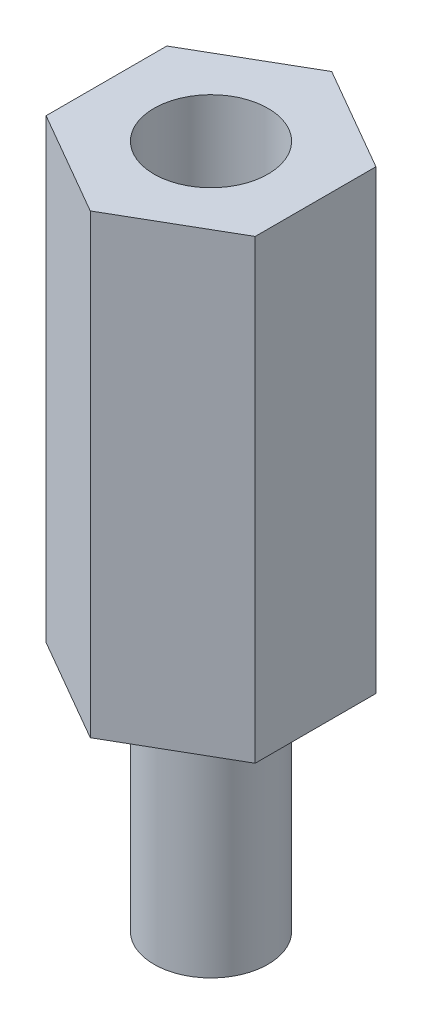
ISO-10303-21;
HEADER;
FILE_DESCRIPTION(('STEP AP214'),'2;1');
FILE_NAME('part.step','',(''),(''),'','','');
FILE_SCHEMA(('AUTOMOTIVE_DESIGN { 1 0 10303 214 1 1 1 1 }'));
ENDSEC;
DATA;
#1=APPLICATION_CONTEXT('core data for automotive mechanical design processes');
#2=APPLICATION_PROTOCOL_DEFINITION('international standard','automotive_design',2000,#1);
#3=PRODUCT_CONTEXT('',#1,'mechanical');
#4=PRODUCT('Part','Part','',(#3));
#5=PRODUCT_RELATED_PRODUCT_CATEGORY('part','',(#4));
#6=PRODUCT_DEFINITION_FORMATION('','',#4);
#7=PRODUCT_DEFINITION_CONTEXT('part definition',#1,'design');
#8=PRODUCT_DEFINITION('design','',#6,#7);
#9=PRODUCT_DEFINITION_SHAPE('','',#8);
#10=(LENGTH_UNIT() NAMED_UNIT(*) SI_UNIT(.MILLI.,.METRE.));
#11=(NAMED_UNIT(*) PLANE_ANGLE_UNIT() SI_UNIT($,.RADIAN.));
#12=(NAMED_UNIT(*) SI_UNIT($,.STERADIAN.) SOLID_ANGLE_UNIT());
#13=UNCERTAINTY_MEASURE_WITH_UNIT(LENGTH_MEASURE(1.E-05),#10,'distance_accuracy_value','');
#14=(GEOMETRIC_REPRESENTATION_CONTEXT(3) GLOBAL_UNCERTAINTY_ASSIGNED_CONTEXT((#13)) GLOBAL_UNIT_ASSIGNED_CONTEXT((#10,
#11,#12)) REPRESENTATION_CONTEXT('',''));
#15=CARTESIAN_POINT('',(0.,0.,0.));
#16=DIRECTION('',(0.,0.,1.));
#17=DIRECTION('',(1.,0.,0.));
#18=AXIS2_PLACEMENT_3D('',#15,#16,#17);
#19=CARTESIAN_POINT('',(2.74999999999998,12.,-1.5877132402715));
#20=DIRECTION('',(-0.499999999999995,0.,0.866025403784441));
#21=DIRECTION('',(0.866025403784441,0.,0.499999999999995));
#22=AXIS2_PLACEMENT_3D('',#19,#20,#21);
#23=PLANE('',#22);
#24=DIRECTION('',(-0.866025403784441,0.,-0.499999999999995));
#25=VECTOR('',#24,1.);
#26=CARTESIAN_POINT('',(2.74999999999998,0.,-1.5877132402715));
#27=LINE('',#26,#25);
#28=CARTESIAN_POINT('',(2.74999999999998,0.,-1.5877132402715));
#29=VERTEX_POINT('',#28);
#30=CARTESIAN_POINT('',(0.,0.,-3.17542648054294));
#31=VERTEX_POINT('',#30);
#32=EDGE_CURVE('E120',#29,#31,#27,.T.);
#33=ORIENTED_EDGE('',*,*,#32,.T.);
#34=DIRECTION('',(0.,-1.,0.));
#35=VECTOR('',#34,1.);
#36=CARTESIAN_POINT('',(0.,12.,-3.17542648054294));
#37=LINE('',#36,#35);
#38=CARTESIAN_POINT('',(0.,12.,-3.17542648054294));
#39=VERTEX_POINT('',#38);
#40=EDGE_CURVE('E37',#39,#31,#37,.T.);
#41=ORIENTED_EDGE('',*,*,#40,.F.);
#42=DIRECTION('',(-0.866025403784441,0.,-0.499999999999995));
#43=VECTOR('',#42,1.);
#44=CARTESIAN_POINT('',(2.74999999999998,12.,-1.5877132402715));
#45=LINE('',#44,#43);
#46=CARTESIAN_POINT('',(2.74999999999998,12.,-1.5877132402715));
#47=VERTEX_POINT('',#46);
#48=EDGE_CURVE('E131',#47,#39,#45,.T.);
#49=ORIENTED_EDGE('',*,*,#48,.F.);
#50=DIRECTION('',(0.,-1.,0.));
#51=VECTOR('',#50,1.);
#52=CARTESIAN_POINT('',(2.74999999999998,12.,-1.5877132402715));
#53=LINE('',#52,#51);
#54=EDGE_CURVE('E116',#47,#29,#53,.T.);
#55=ORIENTED_EDGE('',*,*,#54,.T.);
#56=EDGE_LOOP('',(#33,#41,#49,#55));
#57=FACE_BOUND('',#56,.T.);
#58=ADVANCED_FACE('F34',(#57),#23,.F.);
#59=CARTESIAN_POINT('',(0.,12.,-3.17542648054294));
#60=DIRECTION('',(0.500000000000001,0.,0.866025403784438));
#61=DIRECTION('',(0.866025403784438,0.,-0.500000000000001));
#62=AXIS2_PLACEMENT_3D('',#59,#60,#61);
#63=PLANE('',#62);
#64=DIRECTION('',(-0.866025403784438,0.,0.500000000000001));
#65=VECTOR('',#64,1.);
#66=CARTESIAN_POINT('',(0.,0.,-3.17542648054294));
#67=LINE('',#66,#65);
#68=CARTESIAN_POINT('',(-2.75,0.,-1.58771324027146));
#69=VERTEX_POINT('',#68);
#70=EDGE_CURVE('E123',#31,#69,#67,.T.);
#71=ORIENTED_EDGE('',*,*,#70,.T.);
#72=DIRECTION('',(0.,-1.,0.));
#73=VECTOR('',#72,1.);
#74=CARTESIAN_POINT('',(-2.75,12.,-1.58771324027146));
#75=LINE('',#74,#73);
#76=CARTESIAN_POINT('',(-2.75,12.,-1.58771324027146));
#77=VERTEX_POINT('',#76);
#78=EDGE_CURVE('E134',#77,#69,#75,.T.);
#79=ORIENTED_EDGE('',*,*,#78,.F.);
#80=DIRECTION('',(-0.866025403784438,0.,0.500000000000001));
#81=VECTOR('',#80,1.);
#82=CARTESIAN_POINT('',(0.,12.,-3.17542648054294));
#83=LINE('',#82,#81);
#84=EDGE_CURVE('E89',#39,#77,#83,.T.);
#85=ORIENTED_EDGE('',*,*,#84,.F.);
#86=ORIENTED_EDGE('',*,*,#40,.T.);
#87=EDGE_LOOP('',(#71,#79,#85,#86));
#88=FACE_BOUND('',#87,.T.);
#89=ADVANCED_FACE('F139',(#88),#63,.F.);
#90=CARTESIAN_POINT('',(-2.75,12.,-1.58771324027146));
#91=DIRECTION('',(1.,0.,0.));
#92=DIRECTION('',(0.,0.,-1.));
#93=AXIS2_PLACEMENT_3D('',#90,#91,#92);
#94=PLANE('',#93);
#95=DIRECTION('',(0.,0.,1.));
#96=VECTOR('',#95,1.);
#97=CARTESIAN_POINT('',(-2.75,0.,-1.58771324027146));
#98=LINE('',#97,#96);
#99=CARTESIAN_POINT('',(-2.74999999999999,0.,1.58771324027148));
#100=VERTEX_POINT('',#99);
#101=EDGE_CURVE('E126',#69,#100,#98,.T.);
#102=ORIENTED_EDGE('',*,*,#101,.T.);
#103=DIRECTION('',(0.,-1.,0.));
#104=VECTOR('',#103,1.);
#105=CARTESIAN_POINT('',(-2.74999999999999,12.,1.58771324027148));
#106=LINE('',#105,#104);
#107=CARTESIAN_POINT('',(-2.74999999999999,12.,1.58771324027148));
#108=VERTEX_POINT('',#107);
#109=EDGE_CURVE('E111',#108,#100,#106,.T.);
#110=ORIENTED_EDGE('',*,*,#109,.F.);
#111=DIRECTION('',(0.,0.,1.));
#112=VECTOR('',#111,1.);
#113=CARTESIAN_POINT('',(-2.75,12.,-1.58771324027146));
#114=LINE('',#113,#112);
#115=EDGE_CURVE('E102',#77,#108,#114,.T.);
#116=ORIENTED_EDGE('',*,*,#115,.F.);
#117=ORIENTED_EDGE('',*,*,#78,.T.);
#118=EDGE_LOOP('',(#102,#110,#116,#117));
#119=FACE_BOUND('',#118,.T.);
#120=ADVANCED_FACE('F145',(#119),#94,.F.);
#121=CARTESIAN_POINT('',(-2.74999999999999,12.,1.58771324027148));
#122=DIRECTION('',(0.499999999999995,0.,-0.866025403784441));
#123=DIRECTION('',(-0.866025403784442,0.,-0.499999999999995));
#124=AXIS2_PLACEMENT_3D('',#121,#122,#123);
#125=PLANE('',#124);
#126=DIRECTION('',(0.866025403784442,0.,0.499999999999995));
#127=VECTOR('',#126,1.);
#128=CARTESIAN_POINT('',(-2.74999999999999,0.,1.58771324027148));
#129=LINE('',#128,#127);
#130=CARTESIAN_POINT('',(0.,0.,3.17542648054294));
#131=VERTEX_POINT('',#130);
#132=EDGE_CURVE('E110',#100,#131,#129,.T.);
#133=ORIENTED_EDGE('',*,*,#132,.T.);
#134=DIRECTION('',(0.,-1.,0.));
#135=VECTOR('',#134,1.);
#136=CARTESIAN_POINT('',(0.,12.,3.17542648054294));
#137=LINE('',#136,#135);
#138=CARTESIAN_POINT('',(0.,12.,3.17542648054294));
#139=VERTEX_POINT('',#138);
#140=EDGE_CURVE('E107',#139,#131,#137,.T.);
#141=ORIENTED_EDGE('',*,*,#140,.F.);
#142=DIRECTION('',(0.866025403784442,0.,0.499999999999995));
#143=VECTOR('',#142,1.);
#144=CARTESIAN_POINT('',(-2.74999999999999,12.,1.58771324027148));
#145=LINE('',#144,#143);
#146=EDGE_CURVE('E96',#108,#139,#145,.T.);
#147=ORIENTED_EDGE('',*,*,#146,.F.);
#148=ORIENTED_EDGE('',*,*,#109,.T.);
#149=EDGE_LOOP('',(#133,#141,#147,#148));
#150=FACE_BOUND('',#149,.T.);
#151=ADVANCED_FACE('F108',(#150),#125,.F.);
#152=CARTESIAN_POINT('',(0.,12.,3.17542648054294));
#153=DIRECTION('',(-0.500000000000007,0.,-0.866025403784434));
#154=DIRECTION('',(-0.866025403784435,0.,0.500000000000007));
#155=AXIS2_PLACEMENT_3D('',#152,#153,#154);
#156=PLANE('',#155);
#157=DIRECTION('',(0.866025403784434,0.,-0.500000000000007));
#158=VECTOR('',#157,1.);
#159=CARTESIAN_POINT('',(0.,0.,3.17542648054294));
#160=LINE('',#159,#158);
#161=CARTESIAN_POINT('',(2.75000000000001,0.,1.58771324027144));
#162=VERTEX_POINT('',#161);
#163=EDGE_CURVE('E74',#131,#162,#160,.T.);
#164=ORIENTED_EDGE('',*,*,#163,.T.);
#165=DIRECTION('',(0.,-1.,0.));
#166=VECTOR('',#165,1.);
#167=CARTESIAN_POINT('',(2.75000000000001,12.,1.58771324027144));
#168=LINE('',#167,#166);
#169=CARTESIAN_POINT('',(2.75000000000001,12.,1.58771324027144));
#170=VERTEX_POINT('',#169);
#171=EDGE_CURVE('E112',#170,#162,#168,.T.);
#172=ORIENTED_EDGE('',*,*,#171,.F.);
#173=DIRECTION('',(0.866025403784434,0.,-0.500000000000007));
#174=VECTOR('',#173,1.);
#175=CARTESIAN_POINT('',(0.,12.,3.17542648054294));
#176=LINE('',#175,#174);
#177=EDGE_CURVE('E100',#139,#170,#176,.T.);
#178=ORIENTED_EDGE('',*,*,#177,.F.);
#179=ORIENTED_EDGE('',*,*,#140,.T.);
#180=EDGE_LOOP('',(#164,#172,#178,#179));
#181=FACE_BOUND('',#180,.T.);
#182=ADVANCED_FACE('F114',(#181),#156,.F.);
#183=CARTESIAN_POINT('',(2.75000000000001,12.,1.58771324027144));
#184=DIRECTION('',(-1.,0.,0.));
#185=DIRECTION('',(0.,0.,1.));
#186=AXIS2_PLACEMENT_3D('',#183,#184,#185);
#187=PLANE('',#186);
#188=DIRECTION('',(0.,0.,-1.));
#189=VECTOR('',#188,1.);
#190=CARTESIAN_POINT('',(2.75000000000001,0.,1.58771324027144));
#191=LINE('',#190,#189);
#192=EDGE_CURVE('E80',#162,#29,#191,.T.);
#193=ORIENTED_EDGE('',*,*,#192,.T.);
#194=ORIENTED_EDGE('',*,*,#54,.F.);
#195=DIRECTION('',(0.,0.,-1.));
#196=VECTOR('',#195,1.);
#197=CARTESIAN_POINT('',(2.75000000000001,12.,1.58771324027144));
#198=LINE('',#197,#196);
#199=EDGE_CURVE('E51',#170,#47,#198,.T.);
#200=ORIENTED_EDGE('',*,*,#199,.F.);
#201=ORIENTED_EDGE('',*,*,#171,.T.);
#202=EDGE_LOOP('',(#193,#194,#200,#201));
#203=FACE_BOUND('',#202,.T.);
#204=ADVANCED_FACE('F168',(#203),#187,.F.);
#205=CARTESIAN_POINT('',(0.,12.,0.));
#206=DIRECTION('',(0.,1.,0.));
#207=DIRECTION('',(0.,0.,1.));
#208=AXIS2_PLACEMENT_3D('',#205,#206,#207);
#209=PLANE('',#208);
#210=CARTESIAN_POINT('',(0.,12.,0.));
#211=DIRECTION('',(0.,1.,0.));
#212=DIRECTION('',(0.,0.,1.));
#213=AXIS2_PLACEMENT_3D('',#210,#211,#212);
#214=CIRCLE('',#213,1.5);
#215=CARTESIAN_POINT('',(0.,12.,1.5));
#216=VERTEX_POINT('',#215);
#217=EDGE_CURVE('E152',#216,#216,#214,.T.);
#218=ORIENTED_EDGE('',*,*,#217,.F.);
#219=EDGE_LOOP('',(#218));
#220=FACE_BOUND('',#219,.T.);
#221=ORIENTED_EDGE('',*,*,#48,.T.);
#222=ORIENTED_EDGE('',*,*,#84,.T.);
#223=ORIENTED_EDGE('',*,*,#115,.T.);
#224=ORIENTED_EDGE('',*,*,#146,.T.);
#225=ORIENTED_EDGE('',*,*,#177,.T.);
#226=ORIENTED_EDGE('',*,*,#199,.T.);
#227=EDGE_LOOP('',(#221,#222,#223,#224,#225,#226));
#228=FACE_BOUND('',#227,.T.);
#229=ADVANCED_FACE('F98',(#220,#228),#209,.T.);
#230=CARTESIAN_POINT('',(0.,0.,0.));
#231=DIRECTION('',(0.,1.,0.));
#232=DIRECTION('',(0.,0.,1.));
#233=AXIS2_PLACEMENT_3D('',#230,#231,#232);
#234=PLANE('',#233);
#235=CARTESIAN_POINT('',(0.,0.,0.));
#236=DIRECTION('',(0.,-1.,0.));
#237=DIRECTION('',(0.,0.,-1.));
#238=AXIS2_PLACEMENT_3D('',#235,#236,#237);
#239=CIRCLE('',#238,1.5);
#240=CARTESIAN_POINT('',(0.,0.,-1.5));
#241=VERTEX_POINT('',#240);
#242=EDGE_CURVE('E11',#241,#241,#239,.T.);
#243=ORIENTED_EDGE('',*,*,#242,.F.);
#244=EDGE_LOOP('',(#243));
#245=FACE_BOUND('',#244,.T.);
#246=ORIENTED_EDGE('',*,*,#32,.F.);
#247=ORIENTED_EDGE('',*,*,#192,.F.);
#248=ORIENTED_EDGE('',*,*,#163,.F.);
#249=ORIENTED_EDGE('',*,*,#132,.F.);
#250=ORIENTED_EDGE('',*,*,#101,.F.);
#251=ORIENTED_EDGE('',*,*,#70,.F.);
#252=EDGE_LOOP('',(#246,#247,#248,#249,#250,#251));
#253=FACE_BOUND('',#252,.T.);
#254=ADVANCED_FACE('F144',(#245,#253),#234,.F.);
#255=CARTESIAN_POINT('',(0.,-6.,0.));
#256=DIRECTION('',(0.,1.,0.));
#257=DIRECTION('',(0.,0.,1.));
#258=AXIS2_PLACEMENT_3D('',#255,#256,#257);
#259=CYLINDRICAL_SURFACE('',#258,1.5);
#260=CARTESIAN_POINT('',(0.,-6.,0.));
#261=DIRECTION('',(0.,-1.,0.));
#262=DIRECTION('',(0.,0.,-1.));
#263=AXIS2_PLACEMENT_3D('',#260,#261,#262);
#264=CIRCLE('',#263,1.5);
#265=CARTESIAN_POINT('',(0.,-6.,-1.5));
#266=VERTEX_POINT('',#265);
#267=EDGE_CURVE('E124',#266,#266,#264,.T.);
#268=ORIENTED_EDGE('',*,*,#267,.F.);
#269=EDGE_LOOP('',(#268));
#270=FACE_BOUND('',#269,.T.);
#271=ORIENTED_EDGE('',*,*,#242,.T.);
#272=EDGE_LOOP('',(#271));
#273=FACE_BOUND('',#272,.T.);
#274=ADVANCED_FACE('F174',(#270,#273),#259,.T.);
#275=CARTESIAN_POINT('',(0.,-6.,0.));
#276=DIRECTION('',(0.,-1.,0.));
#277=DIRECTION('',(0.,0.,-1.));
#278=AXIS2_PLACEMENT_3D('',#275,#276,#277);
#279=PLANE('',#278);
#280=ORIENTED_EDGE('',*,*,#267,.T.);
#281=EDGE_LOOP('',(#280));
#282=FACE_BOUND('',#281,.T.);
#283=ADVANCED_FACE('F163',(#282),#279,.T.);
#284=CARTESIAN_POINT('',(0.,6.,0.));
#285=DIRECTION('',(0.,1.,0.));
#286=DIRECTION('',(0.,0.,1.));
#287=AXIS2_PLACEMENT_3D('',#284,#285,#286);
#288=CYLINDRICAL_SURFACE('',#287,1.5);
#289=CARTESIAN_POINT('',(0.,6.,0.));
#290=DIRECTION('',(0.,1.,0.));
#291=DIRECTION('',(0.,0.,1.));
#292=AXIS2_PLACEMENT_3D('',#289,#290,#291);
#293=CIRCLE('',#292,1.5);
#294=CARTESIAN_POINT('',(0.,6.,1.5));
#295=VERTEX_POINT('',#294);
#296=EDGE_CURVE('E151',#295,#295,#293,.T.);
#297=ORIENTED_EDGE('',*,*,#296,.F.);
#298=EDGE_LOOP('',(#297));
#299=FACE_BOUND('',#298,.T.);
#300=ORIENTED_EDGE('',*,*,#217,.T.);
#301=EDGE_LOOP('',(#300));
#302=FACE_BOUND('',#301,.T.);
#303=ADVANCED_FACE('F160',(#299,#302),#288,.F.);
#304=CARTESIAN_POINT('',(0.,6.,0.));
#305=DIRECTION('',(0.,1.,0.));
#306=DIRECTION('',(0.,0.,1.));
#307=AXIS2_PLACEMENT_3D('',#304,#305,#306);
#308=PLANE('',#307);
#309=ORIENTED_EDGE('',*,*,#296,.T.);
#310=EDGE_LOOP('',(#309));
#311=FACE_BOUND('',#310,.T.);
#312=ADVANCED_FACE('F158',(#311),#308,.T.);
#313=CLOSED_SHELL('',(#58,#89,#120,#151,#182,#204,#229,#254,#274,#283,#303,#312));
#314=MANIFOLD_SOLID_BREP('B2',#313);
#315=ADVANCED_BREP_SHAPE_REPRESENTATION('',(#18,#314),#14);
#316=SHAPE_DEFINITION_REPRESENTATION(#9,#315);
ENDSEC;
END-ISO-10303-21;
